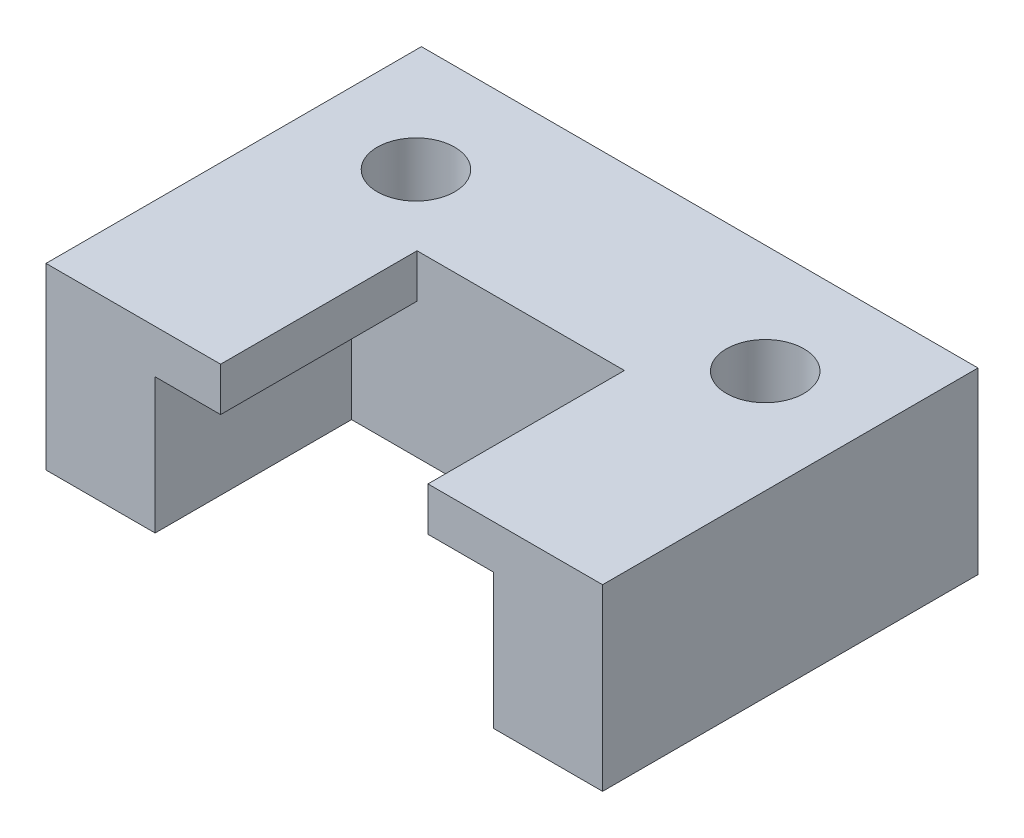
ISO-10303-21;
HEADER;
FILE_DESCRIPTION(('STEP AP214'),'2;1');
FILE_NAME('part.step','',(''),(''),'','','');
FILE_SCHEMA(('AUTOMOTIVE_DESIGN { 1 0 10303 214 1 1 1 1 }'));
ENDSEC;
DATA;
#1=APPLICATION_CONTEXT('core data for automotive mechanical design processes');
#2=APPLICATION_PROTOCOL_DEFINITION('international standard','automotive_design',2000,#1);
#3=PRODUCT_CONTEXT('',#1,'mechanical');
#4=PRODUCT('Part','Part','',(#3));
#5=PRODUCT_RELATED_PRODUCT_CATEGORY('part','',(#4));
#6=PRODUCT_DEFINITION_FORMATION('','',#4);
#7=PRODUCT_DEFINITION_CONTEXT('part definition',#1,'design');
#8=PRODUCT_DEFINITION('design','',#6,#7);
#9=PRODUCT_DEFINITION_SHAPE('','',#8);
#10=(LENGTH_UNIT() NAMED_UNIT(*) SI_UNIT(.MILLI.,.METRE.));
#11=(NAMED_UNIT(*) PLANE_ANGLE_UNIT() SI_UNIT($,.RADIAN.));
#12=(NAMED_UNIT(*) SI_UNIT($,.STERADIAN.) SOLID_ANGLE_UNIT());
#13=UNCERTAINTY_MEASURE_WITH_UNIT(LENGTH_MEASURE(1.E-05),#10,'distance_accuracy_value','');
#14=(GEOMETRIC_REPRESENTATION_CONTEXT(3) GLOBAL_UNCERTAINTY_ASSIGNED_CONTEXT((#13)) GLOBAL_UNIT_ASSIGNED_CONTEXT((#10,
#11,#12)) REPRESENTATION_CONTEXT('',''));
#15=CARTESIAN_POINT('',(0.,0.,0.));
#16=DIRECTION('',(0.,0.,1.));
#17=DIRECTION('',(1.,0.,0.));
#18=AXIS2_PLACEMENT_3D('',#15,#16,#17);
#19=CARTESIAN_POINT('',(-12.75,6.2,0.));
#20=DIRECTION('',(-1.,0.,0.));
#21=DIRECTION('',(0.,0.,1.));
#22=AXIS2_PLACEMENT_3D('',#19,#20,#21);
#23=PLANE('',#22);
#24=DIRECTION('',(0.,0.,-1.));
#25=VECTOR('',#24,1.);
#26=CARTESIAN_POINT('',(-12.75,0.,0.));
#27=LINE('',#26,#25);
#28=CARTESIAN_POINT('',(-12.75,0.,12.2));
#29=VERTEX_POINT('',#28);
#30=CARTESIAN_POINT('',(-12.75,0.,-5.));
#31=VERTEX_POINT('',#30);
#32=EDGE_CURVE('E166',#29,#31,#27,.T.);
#33=ORIENTED_EDGE('',*,*,#32,.F.);
#34=DIRECTION('',(0.,-1.,0.));
#35=VECTOR('',#34,1.);
#36=CARTESIAN_POINT('',(-12.75,6.2,12.2));
#37=LINE('',#36,#35);
#38=CARTESIAN_POINT('',(-12.75,8.2,12.2));
#39=VERTEX_POINT('',#38);
#40=EDGE_CURVE('E12',#39,#29,#37,.T.);
#41=ORIENTED_EDGE('',*,*,#40,.F.);
#42=DIRECTION('',(0.,0.,1.));
#43=VECTOR('',#42,1.);
#44=CARTESIAN_POINT('',(-12.75,8.2,0.));
#45=LINE('',#44,#43);
#46=CARTESIAN_POINT('',(-12.75,8.2,-5.));
#47=VERTEX_POINT('',#46);
#48=EDGE_CURVE('E289',#47,#39,#45,.T.);
#49=ORIENTED_EDGE('',*,*,#48,.F.);
#50=DIRECTION('',(0.,-1.,0.));
#51=VECTOR('',#50,1.);
#52=CARTESIAN_POINT('',(-12.75,6.2,-5.));
#53=LINE('',#52,#51);
#54=EDGE_CURVE('E151',#47,#31,#53,.T.);
#55=ORIENTED_EDGE('',*,*,#54,.T.);
#56=EDGE_LOOP('',(#33,#41,#49,#55));
#57=FACE_BOUND('',#56,.T.);
#58=ADVANCED_FACE('F93',(#57),#23,.T.);
#59=CARTESIAN_POINT('',(0.,6.2,12.2));
#60=DIRECTION('',(0.,0.,1.));
#61=DIRECTION('',(1.,0.,0.));
#62=AXIS2_PLACEMENT_3D('',#59,#60,#61);
#63=PLANE('',#62);
#64=DIRECTION('',(-1.,0.,0.));
#65=VECTOR('',#64,1.);
#66=CARTESIAN_POINT('',(0.,0.,12.2));
#67=LINE('',#66,#65);
#68=CARTESIAN_POINT('',(-7.75,0.,12.2));
#69=VERTEX_POINT('',#68);
#70=EDGE_CURVE('E195',#69,#29,#67,.T.);
#71=ORIENTED_EDGE('',*,*,#70,.F.);
#72=DIRECTION('',(0.,-1.,0.));
#73=VECTOR('',#72,1.);
#74=CARTESIAN_POINT('',(-7.75,6.2,12.2));
#75=LINE('',#74,#73);
#76=CARTESIAN_POINT('',(-7.75,6.2,12.2));
#77=VERTEX_POINT('',#76);
#78=EDGE_CURVE('E102',#77,#69,#75,.T.);
#79=ORIENTED_EDGE('',*,*,#78,.F.);
#80=DIRECTION('',(1.,0.,0.));
#81=VECTOR('',#80,1.);
#82=CARTESIAN_POINT('',(0.,6.2,12.2));
#83=LINE('',#82,#81);
#84=CARTESIAN_POINT('',(-4.75,6.2,12.2));
#85=VERTEX_POINT('',#84);
#86=EDGE_CURVE('E280',#77,#85,#83,.T.);
#87=ORIENTED_EDGE('',*,*,#86,.T.);
#88=DIRECTION('',(0.,-1.,0.));
#89=VECTOR('',#88,1.);
#90=CARTESIAN_POINT('',(-4.75,8.2,12.2));
#91=LINE('',#90,#89);
#92=CARTESIAN_POINT('',(-4.75,8.2,12.2));
#93=VERTEX_POINT('',#92);
#94=EDGE_CURVE('E304',#93,#85,#91,.T.);
#95=ORIENTED_EDGE('',*,*,#94,.F.);
#96=DIRECTION('',(1.,0.,0.));
#97=VECTOR('',#96,1.);
#98=CARTESIAN_POINT('',(0.,8.2,12.2));
#99=LINE('',#98,#97);
#100=EDGE_CURVE('E287',#39,#93,#99,.T.);
#101=ORIENTED_EDGE('',*,*,#100,.F.);
#102=ORIENTED_EDGE('',*,*,#40,.T.);
#103=EDGE_LOOP('',(#71,#79,#87,#95,#101,#102));
#104=FACE_BOUND('',#103,.T.);
#105=ADVANCED_FACE('F196',(#104),#63,.T.);
#106=CARTESIAN_POINT('',(-7.75,6.2,0.));
#107=DIRECTION('',(1.,0.,0.));
#108=DIRECTION('',(0.,0.,-1.));
#109=AXIS2_PLACEMENT_3D('',#106,#107,#108);
#110=PLANE('',#109);
#111=DIRECTION('',(0.,0.,1.));
#112=VECTOR('',#111,1.);
#113=CARTESIAN_POINT('',(-7.75,0.,0.));
#114=LINE('',#113,#112);
#115=CARTESIAN_POINT('',(-7.75,0.,3.2));
#116=VERTEX_POINT('',#115);
#117=EDGE_CURVE('E189',#116,#69,#114,.T.);
#118=ORIENTED_EDGE('',*,*,#117,.F.);
#119=DIRECTION('',(0.,-1.,0.));
#120=VECTOR('',#119,1.);
#121=CARTESIAN_POINT('',(-7.75,6.2,3.2));
#122=LINE('',#121,#120);
#123=CARTESIAN_POINT('',(-7.75,6.2,3.2));
#124=VERTEX_POINT('',#123);
#125=EDGE_CURVE('E181',#124,#116,#122,.T.);
#126=ORIENTED_EDGE('',*,*,#125,.F.);
#127=DIRECTION('',(0.,0.,1.));
#128=VECTOR('',#127,1.);
#129=CARTESIAN_POINT('',(-7.75,6.2,0.));
#130=LINE('',#129,#128);
#131=EDGE_CURVE('E167',#124,#77,#130,.T.);
#132=ORIENTED_EDGE('',*,*,#131,.T.);
#133=ORIENTED_EDGE('',*,*,#78,.T.);
#134=EDGE_LOOP('',(#118,#126,#132,#133));
#135=FACE_BOUND('',#134,.T.);
#136=ADVANCED_FACE('F186',(#135),#110,.T.);
#137=CARTESIAN_POINT('',(0.,6.2,3.2));
#138=DIRECTION('',(0.,0.,1.));
#139=DIRECTION('',(1.,0.,0.));
#140=AXIS2_PLACEMENT_3D('',#137,#138,#139);
#141=PLANE('',#140);
#142=DIRECTION('',(-1.,0.,0.));
#143=VECTOR('',#142,1.);
#144=CARTESIAN_POINT('',(0.,0.,3.2));
#145=LINE('',#144,#143);
#146=CARTESIAN_POINT('',(7.75,0.,3.2));
#147=VERTEX_POINT('',#146);
#148=EDGE_CURVE('E202',#147,#116,#145,.T.);
#149=ORIENTED_EDGE('',*,*,#148,.F.);
#150=DIRECTION('',(0.,-1.,0.));
#151=VECTOR('',#150,1.);
#152=CARTESIAN_POINT('',(7.75,6.2,3.2));
#153=LINE('',#152,#151);
#154=CARTESIAN_POINT('',(7.75,6.2,3.2));
#155=VERTEX_POINT('',#154);
#156=EDGE_CURVE('E179',#155,#147,#153,.T.);
#157=ORIENTED_EDGE('',*,*,#156,.F.);
#158=DIRECTION('',(-1.,0.,0.));
#159=VECTOR('',#158,1.);
#160=CARTESIAN_POINT('',(0.,6.2,3.2));
#161=LINE('',#160,#159);
#162=CARTESIAN_POINT('',(4.75,6.2,3.2));
#163=VERTEX_POINT('',#162);
#164=EDGE_CURVE('E109',#155,#163,#161,.T.);
#165=ORIENTED_EDGE('',*,*,#164,.T.);
#166=DIRECTION('',(0.,-1.,0.));
#167=VECTOR('',#166,1.);
#168=CARTESIAN_POINT('',(4.75,8.2,3.2));
#169=LINE('',#168,#167);
#170=CARTESIAN_POINT('',(4.75,8.2,3.2));
#171=VERTEX_POINT('',#170);
#172=EDGE_CURVE('E271',#171,#163,#169,.T.);
#173=ORIENTED_EDGE('',*,*,#172,.F.);
#174=DIRECTION('',(1.,0.,0.));
#175=VECTOR('',#174,1.);
#176=CARTESIAN_POINT('',(0.,8.2,3.2));
#177=LINE('',#176,#175);
#178=CARTESIAN_POINT('',(-4.75,8.2,3.2));
#179=VERTEX_POINT('',#178);
#180=EDGE_CURVE('E262',#179,#171,#177,.T.);
#181=ORIENTED_EDGE('',*,*,#180,.F.);
#182=DIRECTION('',(0.,-1.,0.));
#183=VECTOR('',#182,1.);
#184=CARTESIAN_POINT('',(-4.75,8.2,3.2));
#185=LINE('',#184,#183);
#186=CARTESIAN_POINT('',(-4.75,6.2,3.2));
#187=VERTEX_POINT('',#186);
#188=EDGE_CURVE('E274',#179,#187,#185,.T.);
#189=ORIENTED_EDGE('',*,*,#188,.T.);
#190=EDGE_CURVE('E170',#187,#124,#161,.T.);
#191=ORIENTED_EDGE('',*,*,#190,.T.);
#192=ORIENTED_EDGE('',*,*,#125,.T.);
#193=EDGE_LOOP('',(#149,#157,#165,#173,#181,#189,#191,#192));
#194=FACE_BOUND('',#193,.T.);
#195=ADVANCED_FACE('F224',(#194),#141,.T.);
#196=CARTESIAN_POINT('',(7.75,6.2,0.));
#197=DIRECTION('',(-1.,0.,0.));
#198=DIRECTION('',(0.,0.,1.));
#199=AXIS2_PLACEMENT_3D('',#196,#197,#198);
#200=PLANE('',#199);
#201=DIRECTION('',(0.,0.,-1.));
#202=VECTOR('',#201,1.);
#203=CARTESIAN_POINT('',(7.75,0.,0.));
#204=LINE('',#203,#202);
#205=CARTESIAN_POINT('',(7.75,0.,12.2));
#206=VERTEX_POINT('',#205);
#207=EDGE_CURVE('E204',#206,#147,#204,.T.);
#208=ORIENTED_EDGE('',*,*,#207,.F.);
#209=DIRECTION('',(0.,-1.,0.));
#210=VECTOR('',#209,1.);
#211=CARTESIAN_POINT('',(7.75,6.2,12.2));
#212=LINE('',#211,#210);
#213=CARTESIAN_POINT('',(7.75,6.2,12.2));
#214=VERTEX_POINT('',#213);
#215=EDGE_CURVE('E177',#214,#206,#212,.T.);
#216=ORIENTED_EDGE('',*,*,#215,.F.);
#217=DIRECTION('',(0.,0.,-1.));
#218=VECTOR('',#217,1.);
#219=CARTESIAN_POINT('',(7.75,6.2,0.));
#220=LINE('',#219,#218);
#221=EDGE_CURVE('E174',#214,#155,#220,.T.);
#222=ORIENTED_EDGE('',*,*,#221,.T.);
#223=ORIENTED_EDGE('',*,*,#156,.T.);
#224=EDGE_LOOP('',(#208,#216,#222,#223));
#225=FACE_BOUND('',#224,.T.);
#226=ADVANCED_FACE('F222',(#225),#200,.T.);
#227=CARTESIAN_POINT('',(0.,6.2,12.2));
#228=DIRECTION('',(0.,0.,1.));
#229=DIRECTION('',(1.,0.,0.));
#230=AXIS2_PLACEMENT_3D('',#227,#228,#229);
#231=PLANE('',#230);
#232=DIRECTION('',(-1.,0.,0.));
#233=VECTOR('',#232,1.);
#234=CARTESIAN_POINT('',(0.,0.,12.2));
#235=LINE('',#234,#233);
#236=CARTESIAN_POINT('',(12.75,0.,12.2));
#237=VERTEX_POINT('',#236);
#238=EDGE_CURVE('E160',#237,#206,#235,.T.);
#239=ORIENTED_EDGE('',*,*,#238,.F.);
#240=DIRECTION('',(0.,-1.,0.));
#241=VECTOR('',#240,1.);
#242=CARTESIAN_POINT('',(12.75,6.2,12.2));
#243=LINE('',#242,#241);
#244=CARTESIAN_POINT('',(12.75,8.2,12.2));
#245=VERTEX_POINT('',#244);
#246=EDGE_CURVE('E150',#245,#237,#243,.T.);
#247=ORIENTED_EDGE('',*,*,#246,.F.);
#248=DIRECTION('',(1.,0.,0.));
#249=VECTOR('',#248,1.);
#250=CARTESIAN_POINT('',(0.,8.2,12.2));
#251=LINE('',#250,#249);
#252=CARTESIAN_POINT('',(4.75,8.2,12.2));
#253=VERTEX_POINT('',#252);
#254=EDGE_CURVE('E275',#253,#245,#251,.T.);
#255=ORIENTED_EDGE('',*,*,#254,.F.);
#256=DIRECTION('',(0.,-1.,0.));
#257=VECTOR('',#256,1.);
#258=CARTESIAN_POINT('',(4.75,8.2,12.2));
#259=LINE('',#258,#257);
#260=CARTESIAN_POINT('',(4.75,6.2,12.2));
#261=VERTEX_POINT('',#260);
#262=EDGE_CURVE('E278',#253,#261,#259,.T.);
#263=ORIENTED_EDGE('',*,*,#262,.T.);
#264=DIRECTION('',(1.,0.,0.));
#265=VECTOR('',#264,1.);
#266=CARTESIAN_POINT('',(0.,6.2,12.2));
#267=LINE('',#266,#265);
#268=EDGE_CURVE('E219',#261,#214,#267,.T.);
#269=ORIENTED_EDGE('',*,*,#268,.T.);
#270=ORIENTED_EDGE('',*,*,#215,.T.);
#271=EDGE_LOOP('',(#239,#247,#255,#263,#269,#270));
#272=FACE_BOUND('',#271,.T.);
#273=ADVANCED_FACE('F210',(#272),#231,.T.);
#274=CARTESIAN_POINT('',(12.75,6.2,0.));
#275=DIRECTION('',(1.,0.,0.));
#276=DIRECTION('',(0.,0.,-1.));
#277=AXIS2_PLACEMENT_3D('',#274,#275,#276);
#278=PLANE('',#277);
#279=DIRECTION('',(0.,0.,1.));
#280=VECTOR('',#279,1.);
#281=CARTESIAN_POINT('',(12.75,0.,0.));
#282=LINE('',#281,#280);
#283=CARTESIAN_POINT('',(12.75,0.,-5.));
#284=VERTEX_POINT('',#283);
#285=EDGE_CURVE('E154',#284,#237,#282,.T.);
#286=ORIENTED_EDGE('',*,*,#285,.F.);
#287=DIRECTION('',(0.,-1.,0.));
#288=VECTOR('',#287,1.);
#289=CARTESIAN_POINT('',(12.75,6.2,-5.));
#290=LINE('',#289,#288);
#291=CARTESIAN_POINT('',(12.75,8.2,-5.));
#292=VERTEX_POINT('',#291);
#293=EDGE_CURVE('E138',#292,#284,#290,.T.);
#294=ORIENTED_EDGE('',*,*,#293,.F.);
#295=DIRECTION('',(0.,0.,-1.));
#296=VECTOR('',#295,1.);
#297=CARTESIAN_POINT('',(12.75,8.2,0.));
#298=LINE('',#297,#296);
#299=EDGE_CURVE('E293',#245,#292,#298,.T.);
#300=ORIENTED_EDGE('',*,*,#299,.F.);
#301=ORIENTED_EDGE('',*,*,#246,.T.);
#302=EDGE_LOOP('',(#286,#294,#300,#301));
#303=FACE_BOUND('',#302,.T.);
#304=ADVANCED_FACE('F155',(#303),#278,.T.);
#305=CARTESIAN_POINT('',(-8.,6.2,0.));
#306=DIRECTION('',(0.,-1.,0.));
#307=DIRECTION('',(0.,0.,-1.));
#308=AXIS2_PLACEMENT_3D('',#305,#306,#307);
#309=CYLINDRICAL_SURFACE('',#308,1.775);
#310=CARTESIAN_POINT('',(-8.,0.,0.));
#311=DIRECTION('',(0.,1.,0.));
#312=DIRECTION('',(0.,0.,1.));
#313=AXIS2_PLACEMENT_3D('',#310,#311,#312);
#314=CIRCLE('',#313,1.775);
#315=CARTESIAN_POINT('',(-8.,0.,-1.775));
#316=VERTEX_POINT('',#315);
#317=EDGE_CURVE('E312',#316,#316,#314,.T.);
#318=CARTESIAN_POINT('',(-8.,8.2,0.));
#319=DIRECTION('',(0.,1.,0.));
#320=DIRECTION('',(0.,0.,1.));
#321=AXIS2_PLACEMENT_3D('',#318,#319,#320);
#322=CIRCLE('',#321,1.775);
#323=CARTESIAN_POINT('',(-8.,8.2,-1.775));
#324=VERTEX_POINT('',#323);
#325=EDGE_CURVE('E322',#324,#324,#322,.T.);
#326=CARTESIAN_POINT('',(-8.,0.,-1.775));
#327=CARTESIAN_POINT('',(-8.,0.0854166666666664,-1.775));
#328=CARTESIAN_POINT('',(-8.,0.170833333333333,-1.775));
#329=CARTESIAN_POINT('',(-8.,0.341666666666666,-1.775));
#330=CARTESIAN_POINT('',(-8.,0.427083333333333,-1.775));
#331=CARTESIAN_POINT('',(-8.,0.597916666666667,-1.775));
#332=CARTESIAN_POINT('',(-8.,0.683333333333334,-1.775));
#333=CARTESIAN_POINT('',(-8.,0.854166666666667,-1.775));
#334=CARTESIAN_POINT('',(-8.,0.939583333333333,-1.775));
#335=CARTESIAN_POINT('',(-8.,1.11041666666667,-1.775));
#336=CARTESIAN_POINT('',(-8.,1.19583333333333,-1.775));
#337=CARTESIAN_POINT('',(-8.,1.36666666666667,-1.775));
#338=CARTESIAN_POINT('',(-8.,1.45208333333333,-1.775));
#339=CARTESIAN_POINT('',(-8.,1.62291666666667,-1.775));
#340=CARTESIAN_POINT('',(-8.,1.70833333333333,-1.775));
#341=CARTESIAN_POINT('',(-8.,1.87916666666667,-1.775));
#342=CARTESIAN_POINT('',(-8.,1.96458333333333,-1.775));
#343=CARTESIAN_POINT('',(-8.,2.13541666666667,-1.775));
#344=CARTESIAN_POINT('',(-8.,2.22083333333333,-1.775));
#345=CARTESIAN_POINT('',(-8.,2.39166666666667,-1.775));
#346=CARTESIAN_POINT('',(-8.,2.47708333333333,-1.775));
#347=CARTESIAN_POINT('',(-8.,2.64791666666667,-1.775));
#348=CARTESIAN_POINT('',(-8.,2.73333333333333,-1.775));
#349=CARTESIAN_POINT('',(-8.,2.90416666666667,-1.775));
#350=CARTESIAN_POINT('',(-8.,2.98958333333333,-1.775));
#351=CARTESIAN_POINT('',(-8.,3.16041666666667,-1.775));
#352=CARTESIAN_POINT('',(-8.,3.24583333333333,-1.775));
#353=CARTESIAN_POINT('',(-8.,3.41666666666667,-1.775));
#354=CARTESIAN_POINT('',(-8.,3.50208333333333,-1.775));
#355=CARTESIAN_POINT('',(-8.,3.67291666666667,-1.775));
#356=CARTESIAN_POINT('',(-8.,3.75833333333333,-1.775));
#357=CARTESIAN_POINT('',(-8.,3.92916666666667,-1.775));
#358=CARTESIAN_POINT('',(-8.,4.01458333333333,-1.775));
#359=CARTESIAN_POINT('',(-8.,4.18541666666667,-1.775));
#360=CARTESIAN_POINT('',(-8.,4.27083333333333,-1.775));
#361=CARTESIAN_POINT('',(-8.,4.44166666666666,-1.775));
#362=CARTESIAN_POINT('',(-8.,4.52708333333333,-1.775));
#363=CARTESIAN_POINT('',(-8.,4.69791666666667,-1.775));
#364=CARTESIAN_POINT('',(-8.,4.78333333333333,-1.775));
#365=CARTESIAN_POINT('',(-8.,4.95416666666667,-1.775));
#366=CARTESIAN_POINT('',(-8.,5.03958333333333,-1.775));
#367=CARTESIAN_POINT('',(-8.,5.21041666666667,-1.775));
#368=CARTESIAN_POINT('',(-8.,5.29583333333333,-1.775));
#369=CARTESIAN_POINT('',(-8.,5.46666666666667,-1.775));
#370=CARTESIAN_POINT('',(-8.,5.55208333333333,-1.775));
#371=CARTESIAN_POINT('',(-8.,5.72291666666667,-1.775));
#372=CARTESIAN_POINT('',(-8.,5.80833333333333,-1.775));
#373=CARTESIAN_POINT('',(-8.,5.97916666666667,-1.775));
#374=CARTESIAN_POINT('',(-8.,6.06458333333333,-1.775));
#375=CARTESIAN_POINT('',(-8.,6.23541666666666,-1.775));
#376=CARTESIAN_POINT('',(-8.,6.32083333333333,-1.775));
#377=CARTESIAN_POINT('',(-8.,6.49166666666666,-1.775));
#378=CARTESIAN_POINT('',(-8.,6.57708333333333,-1.775));
#379=CARTESIAN_POINT('',(-8.,6.74791666666667,-1.775));
#380=CARTESIAN_POINT('',(-8.,6.83333333333333,-1.775));
#381=CARTESIAN_POINT('',(-8.,7.00416666666667,-1.775));
#382=CARTESIAN_POINT('',(-8.,7.08958333333333,-1.775));
#383=CARTESIAN_POINT('',(-8.,7.26041666666667,-1.775));
#384=CARTESIAN_POINT('',(-8.,7.34583333333333,-1.775));
#385=CARTESIAN_POINT('',(-8.,7.51666666666666,-1.775));
#386=CARTESIAN_POINT('',(-8.,7.60208333333333,-1.775));
#387=CARTESIAN_POINT('',(-8.,7.77291666666667,-1.775));
#388=CARTESIAN_POINT('',(-8.,7.85833333333333,-1.775));
#389=CARTESIAN_POINT('',(-8.,8.02916666666666,-1.775));
#390=CARTESIAN_POINT('',(-8.,8.11458333333333,-1.775));
#391=CARTESIAN_POINT('',(-8.,8.2,-1.775));
#392=B_SPLINE_CURVE_WITH_KNOTS('',3,(#326,#327,#328,#329,#330,#331,#332,#333,#334,#335,#336,
#337,#338,#339,#340,#341,#342,#343,#344,#345,#346,#347,#348,#349,#350,#351,#352,#353,#354,#355,
#356,#357,#358,#359,#360,#361,#362,#363,#364,#365,#366,#367,#368,#369,#370,#371,#372,#373,#374,
#375,#376,#377,#378,#379,#380,#381,#382,#383,#384,#385,#386,#387,#388,#389,#390,#391),
.UNSPECIFIED.,.F.,.F.,(4,2,2,2,2,2,2,2,2,2,2,2,2,2,2,2,2,2,2,2,2,2,2,2,2,2,2,2,2,2,2,2,4),(0.,
0.25625,0.5125,0.76875,1.025,1.28125,1.5375,1.79375,2.05,2.30625,2.5625,2.81875,3.075,3.33125,
3.5875,3.84375,4.1,4.35625,4.6125,4.86875,5.125,5.38125,5.6375,5.89375,6.15,6.40625,6.6625,
6.91875,7.175,7.43125,7.6875,7.94375,8.2),.UNSPECIFIED.);
#393=EDGE_CURVE('BSEAM317',#316,#324,#392,.T.);
#394=ORIENTED_EDGE('',*,*,#317,.F.);
#395=ORIENTED_EDGE('',*,*,#325,.T.);
#396=ORIENTED_EDGE('',*,*,#393,.T.);
#397=ORIENTED_EDGE('',*,*,#393,.F.);
#398=EDGE_LOOP('',(#394,#396,#395,#397));
#399=FACE_BOUND('',#398,.T.);
#400=ADVANCED_FACE('F317',(#399),#309,.F.);
#401=CARTESIAN_POINT('',(8.,6.2,0.));
#402=DIRECTION('',(0.,-1.,0.));
#403=DIRECTION('',(0.,0.,-1.));
#404=AXIS2_PLACEMENT_3D('',#401,#402,#403);
#405=CYLINDRICAL_SURFACE('',#404,1.775);
#406=CARTESIAN_POINT('',(8.,0.,0.));
#407=DIRECTION('',(0.,1.,0.));
#408=DIRECTION('',(0.,0.,1.));
#409=AXIS2_PLACEMENT_3D('',#406,#407,#408);
#410=CIRCLE('',#409,1.775);
#411=CARTESIAN_POINT('',(8.,0.,-1.775));
#412=VERTEX_POINT('',#411);
#413=EDGE_CURVE('E303',#412,#412,#410,.T.);
#414=CARTESIAN_POINT('',(8.,8.2,0.));
#415=DIRECTION('',(0.,1.,0.));
#416=DIRECTION('',(0.,0.,1.));
#417=AXIS2_PLACEMENT_3D('',#414,#415,#416);
#418=CIRCLE('',#417,1.775);
#419=CARTESIAN_POINT('',(8.,8.2,-1.775));
#420=VERTEX_POINT('',#419);
#421=EDGE_CURVE('E283',#420,#420,#418,.T.);
#422=CARTESIAN_POINT('',(8.,0.,-1.775));
#423=CARTESIAN_POINT('',(8.,0.0854166666666664,-1.775));
#424=CARTESIAN_POINT('',(8.,0.170833333333333,-1.775));
#425=CARTESIAN_POINT('',(8.,0.341666666666666,-1.775));
#426=CARTESIAN_POINT('',(8.,0.427083333333333,-1.775));
#427=CARTESIAN_POINT('',(8.,0.597916666666667,-1.775));
#428=CARTESIAN_POINT('',(8.,0.683333333333334,-1.775));
#429=CARTESIAN_POINT('',(8.,0.854166666666667,-1.775));
#430=CARTESIAN_POINT('',(8.,0.939583333333333,-1.775));
#431=CARTESIAN_POINT('',(8.,1.11041666666667,-1.775));
#432=CARTESIAN_POINT('',(8.,1.19583333333333,-1.775));
#433=CARTESIAN_POINT('',(8.,1.36666666666667,-1.775));
#434=CARTESIAN_POINT('',(8.,1.45208333333333,-1.775));
#435=CARTESIAN_POINT('',(8.,1.62291666666667,-1.775));
#436=CARTESIAN_POINT('',(8.,1.70833333333333,-1.775));
#437=CARTESIAN_POINT('',(8.,1.87916666666667,-1.775));
#438=CARTESIAN_POINT('',(8.,1.96458333333333,-1.775));
#439=CARTESIAN_POINT('',(8.,2.13541666666667,-1.775));
#440=CARTESIAN_POINT('',(8.,2.22083333333333,-1.775));
#441=CARTESIAN_POINT('',(8.,2.39166666666667,-1.775));
#442=CARTESIAN_POINT('',(8.,2.47708333333333,-1.775));
#443=CARTESIAN_POINT('',(8.,2.64791666666667,-1.775));
#444=CARTESIAN_POINT('',(8.,2.73333333333333,-1.775));
#445=CARTESIAN_POINT('',(8.,2.90416666666667,-1.775));
#446=CARTESIAN_POINT('',(8.,2.98958333333333,-1.775));
#447=CARTESIAN_POINT('',(8.,3.16041666666667,-1.775));
#448=CARTESIAN_POINT('',(8.,3.24583333333333,-1.775));
#449=CARTESIAN_POINT('',(8.,3.41666666666667,-1.775));
#450=CARTESIAN_POINT('',(8.,3.50208333333333,-1.775));
#451=CARTESIAN_POINT('',(8.,3.67291666666667,-1.775));
#452=CARTESIAN_POINT('',(8.,3.75833333333333,-1.775));
#453=CARTESIAN_POINT('',(8.,3.92916666666667,-1.775));
#454=CARTESIAN_POINT('',(8.,4.01458333333333,-1.775));
#455=CARTESIAN_POINT('',(8.,4.18541666666667,-1.775));
#456=CARTESIAN_POINT('',(8.,4.27083333333333,-1.775));
#457=CARTESIAN_POINT('',(8.,4.44166666666666,-1.775));
#458=CARTESIAN_POINT('',(8.,4.52708333333333,-1.775));
#459=CARTESIAN_POINT('',(8.,4.69791666666667,-1.775));
#460=CARTESIAN_POINT('',(8.,4.78333333333333,-1.775));
#461=CARTESIAN_POINT('',(8.,4.95416666666667,-1.775));
#462=CARTESIAN_POINT('',(8.,5.03958333333333,-1.775));
#463=CARTESIAN_POINT('',(8.,5.21041666666667,-1.775));
#464=CARTESIAN_POINT('',(8.,5.29583333333333,-1.775));
#465=CARTESIAN_POINT('',(8.,5.46666666666667,-1.775));
#466=CARTESIAN_POINT('',(8.,5.55208333333333,-1.775));
#467=CARTESIAN_POINT('',(8.,5.72291666666667,-1.775));
#468=CARTESIAN_POINT('',(8.,5.80833333333333,-1.775));
#469=CARTESIAN_POINT('',(8.,5.97916666666667,-1.775));
#470=CARTESIAN_POINT('',(8.,6.06458333333333,-1.775));
#471=CARTESIAN_POINT('',(8.,6.23541666666666,-1.775));
#472=CARTESIAN_POINT('',(8.,6.32083333333333,-1.775));
#473=CARTESIAN_POINT('',(8.,6.49166666666666,-1.775));
#474=CARTESIAN_POINT('',(8.,6.57708333333333,-1.775));
#475=CARTESIAN_POINT('',(8.,6.74791666666667,-1.775));
#476=CARTESIAN_POINT('',(8.,6.83333333333333,-1.775));
#477=CARTESIAN_POINT('',(8.,7.00416666666667,-1.775));
#478=CARTESIAN_POINT('',(8.,7.08958333333333,-1.775));
#479=CARTESIAN_POINT('',(8.,7.26041666666667,-1.775));
#480=CARTESIAN_POINT('',(8.,7.34583333333333,-1.775));
#481=CARTESIAN_POINT('',(8.,7.51666666666666,-1.775));
#482=CARTESIAN_POINT('',(8.,7.60208333333333,-1.775));
#483=CARTESIAN_POINT('',(8.,7.77291666666667,-1.775));
#484=CARTESIAN_POINT('',(8.,7.85833333333333,-1.775));
#485=CARTESIAN_POINT('',(8.,8.02916666666666,-1.775));
#486=CARTESIAN_POINT('',(8.,8.11458333333333,-1.775));
#487=CARTESIAN_POINT('',(8.,8.2,-1.775));
#488=B_SPLINE_CURVE_WITH_KNOTS('',3,(#422,#423,#424,#425,#426,#427,#428,#429,#430,#431,#432,
#433,#434,#435,#436,#437,#438,#439,#440,#441,#442,#443,#444,#445,#446,#447,#448,#449,#450,#451,
#452,#453,#454,#455,#456,#457,#458,#459,#460,#461,#462,#463,#464,#465,#466,#467,#468,#469,#470,
#471,#472,#473,#474,#475,#476,#477,#478,#479,#480,#481,#482,#483,#484,#485,#486,#487),
.UNSPECIFIED.,.F.,.F.,(4,2,2,2,2,2,2,2,2,2,2,2,2,2,2,2,2,2,2,2,2,2,2,2,2,2,2,2,2,2,2,2,4),(0.,
0.25625,0.5125,0.76875,1.025,1.28125,1.5375,1.79375,2.05,2.30625,2.5625,2.81875,3.075,3.33125,
3.5875,3.84375,4.1,4.35625,4.6125,4.86875,5.125,5.38125,5.6375,5.89375,6.15,6.40625,6.6625,
6.91875,7.175,7.43125,7.6875,7.94375,8.2),.UNSPECIFIED.);
#489=EDGE_CURVE('BSEAM95',#412,#420,#488,.T.);
#490=ORIENTED_EDGE('',*,*,#413,.F.);
#491=ORIENTED_EDGE('',*,*,#421,.T.);
#492=ORIENTED_EDGE('',*,*,#489,.T.);
#493=ORIENTED_EDGE('',*,*,#489,.F.);
#494=EDGE_LOOP('',(#490,#492,#491,#493));
#495=FACE_BOUND('',#494,.T.);
#496=ADVANCED_FACE('F95',(#495),#405,.F.);
#497=CARTESIAN_POINT('',(0.,6.2,-5.));
#498=DIRECTION('',(0.,0.,-1.));
#499=DIRECTION('',(-1.,0.,0.));
#500=AXIS2_PLACEMENT_3D('',#497,#498,#499);
#501=PLANE('',#500);
#502=DIRECTION('',(1.,0.,0.));
#503=VECTOR('',#502,1.);
#504=CARTESIAN_POINT('',(0.,0.,-5.));
#505=LINE('',#504,#503);
#506=EDGE_CURVE('E143',#31,#284,#505,.T.);
#507=ORIENTED_EDGE('',*,*,#506,.F.);
#508=ORIENTED_EDGE('',*,*,#54,.F.);
#509=DIRECTION('',(-1.,0.,0.));
#510=VECTOR('',#509,1.);
#511=CARTESIAN_POINT('',(0.,8.2,-5.));
#512=LINE('',#511,#510);
#513=EDGE_CURVE('E146',#292,#47,#512,.T.);
#514=ORIENTED_EDGE('',*,*,#513,.F.);
#515=ORIENTED_EDGE('',*,*,#293,.T.);
#516=EDGE_LOOP('',(#507,#508,#514,#515));
#517=FACE_BOUND('',#516,.T.);
#518=ADVANCED_FACE('F140',(#517),#501,.T.);
#519=CARTESIAN_POINT('',(0.,0.,0.));
#520=DIRECTION('',(0.,1.,0.));
#521=DIRECTION('',(0.,0.,1.));
#522=AXIS2_PLACEMENT_3D('',#519,#520,#521);
#523=PLANE('',#522);
#524=ORIENTED_EDGE('',*,*,#413,.T.);
#525=EDGE_LOOP('',(#524));
#526=FACE_BOUND('',#525,.T.);
#527=ORIENTED_EDGE('',*,*,#317,.T.);
#528=EDGE_LOOP('',(#527));
#529=FACE_BOUND('',#528,.T.);
#530=ORIENTED_EDGE('',*,*,#32,.T.);
#531=ORIENTED_EDGE('',*,*,#506,.T.);
#532=ORIENTED_EDGE('',*,*,#285,.T.);
#533=ORIENTED_EDGE('',*,*,#238,.T.);
#534=ORIENTED_EDGE('',*,*,#207,.T.);
#535=ORIENTED_EDGE('',*,*,#148,.T.);
#536=ORIENTED_EDGE('',*,*,#117,.T.);
#537=ORIENTED_EDGE('',*,*,#70,.T.);
#538=EDGE_LOOP('',(#530,#531,#532,#533,#534,#535,#536,#537));
#539=FACE_BOUND('',#538,.T.);
#540=ADVANCED_FACE('F163',(#526,#529,#539),#523,.F.);
#541=CARTESIAN_POINT('',(0.,6.2,0.));
#542=DIRECTION('',(0.,-1.,0.));
#543=DIRECTION('',(0.,0.,-1.));
#544=AXIS2_PLACEMENT_3D('',#541,#542,#543);
#545=PLANE('',#544);
#546=ORIENTED_EDGE('',*,*,#131,.F.);
#547=ORIENTED_EDGE('',*,*,#190,.F.);
#548=DIRECTION('',(0.,0.,1.));
#549=VECTOR('',#548,1.);
#550=CARTESIAN_POINT('',(-4.75,6.2,0.));
#551=LINE('',#550,#549);
#552=EDGE_CURVE('E298',#187,#85,#551,.T.);
#553=ORIENTED_EDGE('',*,*,#552,.T.);
#554=ORIENTED_EDGE('',*,*,#86,.F.);
#555=EDGE_LOOP('',(#546,#547,#553,#554));
#556=FACE_BOUND('',#555,.T.);
#557=ADVANCED_FACE('F336',(#556),#545,.T.);
#558=ORIENTED_EDGE('',*,*,#164,.F.);
#559=ORIENTED_EDGE('',*,*,#221,.F.);
#560=ORIENTED_EDGE('',*,*,#268,.F.);
#561=DIRECTION('',(0.,0.,-1.));
#562=VECTOR('',#561,1.);
#563=CARTESIAN_POINT('',(4.75,6.2,0.));
#564=LINE('',#563,#562);
#565=EDGE_CURVE('E296',#261,#163,#564,.T.);
#566=ORIENTED_EDGE('',*,*,#565,.T.);
#567=EDGE_LOOP('',(#558,#559,#560,#566));
#568=FACE_BOUND('',#567,.T.);
#569=ADVANCED_FACE('F328',(#568),#545,.T.);
#570=CARTESIAN_POINT('',(0.,8.2,0.));
#571=DIRECTION('',(0.,-1.,0.));
#572=DIRECTION('',(0.,0.,-1.));
#573=AXIS2_PLACEMENT_3D('',#570,#571,#572);
#574=PLANE('',#573);
#575=DIRECTION('',(0.,0.,-1.));
#576=VECTOR('',#575,1.);
#577=CARTESIAN_POINT('',(4.75,8.2,0.));
#578=LINE('',#577,#576);
#579=EDGE_CURVE('E267',#253,#171,#578,.T.);
#580=ORIENTED_EDGE('',*,*,#579,.F.);
#581=ORIENTED_EDGE('',*,*,#254,.T.);
#582=ORIENTED_EDGE('',*,*,#299,.T.);
#583=ORIENTED_EDGE('',*,*,#513,.T.);
#584=ORIENTED_EDGE('',*,*,#48,.T.);
#585=ORIENTED_EDGE('',*,*,#100,.T.);
#586=DIRECTION('',(0.,0.,1.));
#587=VECTOR('',#586,1.);
#588=CARTESIAN_POINT('',(-4.75,8.2,0.));
#589=LINE('',#588,#587);
#590=EDGE_CURVE('E269',#179,#93,#589,.T.);
#591=ORIENTED_EDGE('',*,*,#590,.F.);
#592=ORIENTED_EDGE('',*,*,#180,.T.);
#593=EDGE_LOOP('',(#580,#581,#582,#583,#584,#585,#591,#592));
#594=FACE_BOUND('',#593,.T.);
#595=ORIENTED_EDGE('',*,*,#421,.F.);
#596=EDGE_LOOP('',(#595));
#597=FACE_BOUND('',#596,.T.);
#598=ORIENTED_EDGE('',*,*,#325,.F.);
#599=EDGE_LOOP('',(#598));
#600=FACE_BOUND('',#599,.T.);
#601=ADVANCED_FACE('F264',(#594,#597,#600),#574,.F.);
#602=CARTESIAN_POINT('',(4.75,8.2,0.));
#603=DIRECTION('',(-1.,0.,0.));
#604=DIRECTION('',(0.,0.,1.));
#605=AXIS2_PLACEMENT_3D('',#602,#603,#604);
#606=PLANE('',#605);
#607=ORIENTED_EDGE('',*,*,#565,.F.);
#608=ORIENTED_EDGE('',*,*,#262,.F.);
#609=ORIENTED_EDGE('',*,*,#579,.T.);
#610=ORIENTED_EDGE('',*,*,#172,.T.);
#611=EDGE_LOOP('',(#607,#608,#609,#610));
#612=FACE_BOUND('',#611,.T.);
#613=ADVANCED_FACE('F277',(#612),#606,.T.);
#614=CARTESIAN_POINT('',(-4.75,8.2,0.));
#615=DIRECTION('',(1.,0.,0.));
#616=DIRECTION('',(0.,0.,-1.));
#617=AXIS2_PLACEMENT_3D('',#614,#615,#616);
#618=PLANE('',#617);
#619=ORIENTED_EDGE('',*,*,#552,.F.);
#620=ORIENTED_EDGE('',*,*,#188,.F.);
#621=ORIENTED_EDGE('',*,*,#590,.T.);
#622=ORIENTED_EDGE('',*,*,#94,.T.);
#623=EDGE_LOOP('',(#619,#620,#621,#622));
#624=FACE_BOUND('',#623,.T.);
#625=ADVANCED_FACE('F334',(#624),#618,.T.);
#626=CLOSED_SHELL('',(#58,#105,#136,#195,#226,#273,#304,#400,#496,#518,#540,#557,#569,#601,#613,#625));
#627=MANIFOLD_SOLID_BREP('B2',#626);
#628=ADVANCED_BREP_SHAPE_REPRESENTATION('',(#18,#627),#14);
#629=SHAPE_DEFINITION_REPRESENTATION(#9,#628);
ENDSEC;
END-ISO-10303-21;
